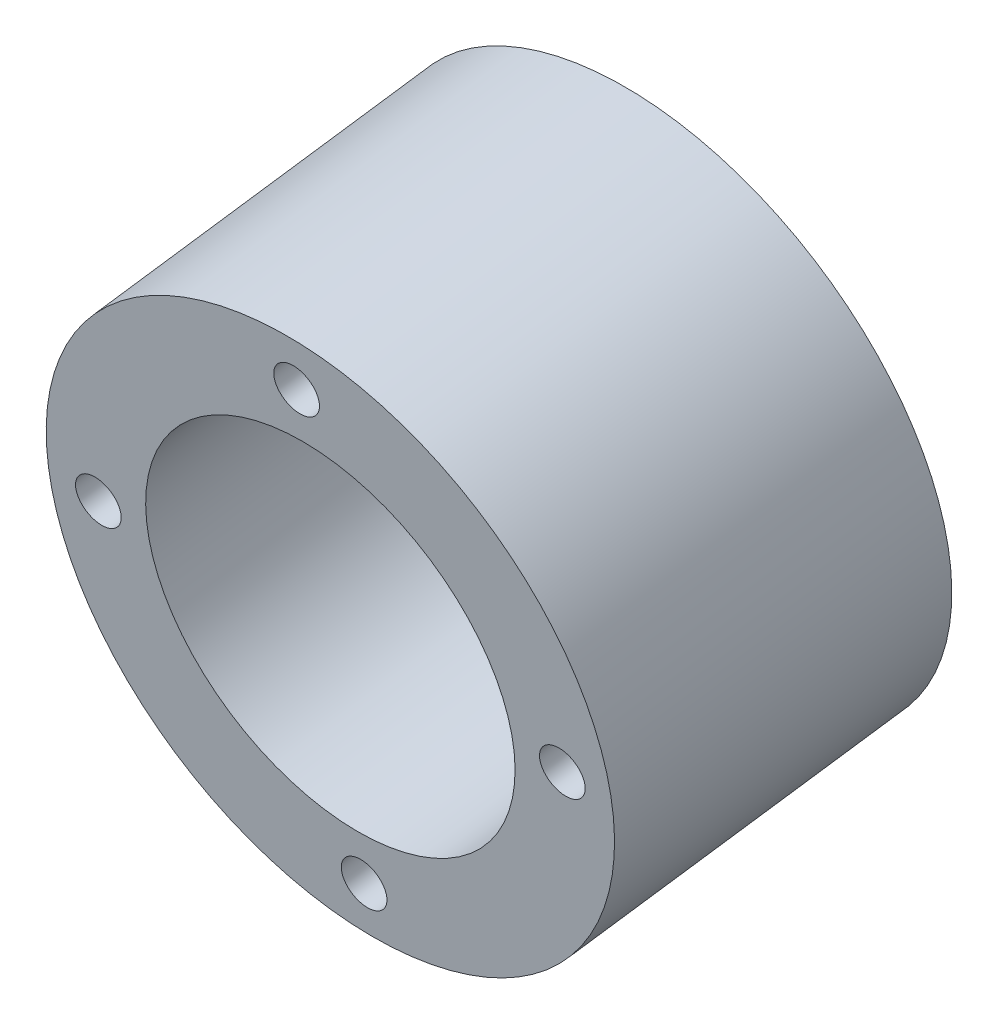
ISO-10303-21;
HEADER;
FILE_DESCRIPTION(('STEP AP214'),'2;1');
FILE_NAME('part.step','',(''),(''),'','','');
FILE_SCHEMA(('AUTOMOTIVE_DESIGN { 1 0 10303 214 1 1 1 1 }'));
ENDSEC;
DATA;
#1=APPLICATION_CONTEXT('core data for automotive mechanical design processes');
#2=APPLICATION_PROTOCOL_DEFINITION('international standard','automotive_design',2000,#1);
#3=PRODUCT_CONTEXT('',#1,'mechanical');
#4=PRODUCT('Part','Part','',(#3));
#5=PRODUCT_RELATED_PRODUCT_CATEGORY('part','',(#4));
#6=PRODUCT_DEFINITION_FORMATION('','',#4);
#7=PRODUCT_DEFINITION_CONTEXT('part definition',#1,'design');
#8=PRODUCT_DEFINITION('design','',#6,#7);
#9=PRODUCT_DEFINITION_SHAPE('','',#8);
#10=(LENGTH_UNIT() NAMED_UNIT(*) SI_UNIT(.MILLI.,.METRE.));
#11=(NAMED_UNIT(*) PLANE_ANGLE_UNIT() SI_UNIT($,.RADIAN.));
#12=(NAMED_UNIT(*) SI_UNIT($,.STERADIAN.) SOLID_ANGLE_UNIT());
#13=UNCERTAINTY_MEASURE_WITH_UNIT(LENGTH_MEASURE(1.E-05),#10,'distance_accuracy_value','');
#14=(GEOMETRIC_REPRESENTATION_CONTEXT(3) GLOBAL_UNCERTAINTY_ASSIGNED_CONTEXT((#13)) GLOBAL_UNIT_ASSIGNED_CONTEXT((#10,
#11,#12)) REPRESENTATION_CONTEXT('',''));
#15=CARTESIAN_POINT('',(0.,0.,0.));
#16=DIRECTION('',(0.,0.,1.));
#17=DIRECTION('',(1.,0.,0.));
#18=AXIS2_PLACEMENT_3D('',#15,#16,#17);
#19=CARTESIAN_POINT('',(0.0954254680110213,580.6831806184,1348.80512087377));
#20=DIRECTION('',(-0.00500921091921221,-0.144685018294151,0.98946508442046));
#21=DIRECTION('',(0.,-0.989477498579028,-0.144686833560589));
#22=AXIS2_PLACEMENT_3D('',#19,#20,#21);
#23=PLANE('',#22);
#24=CARTESIAN_POINT('',(0.0954254680110213,580.6831806184,1348.80512087377));
#25=DIRECTION('',(-0.00500921091921221,-0.144685018294151,0.98946508442046));
#26=DIRECTION('',(0.,-0.989477498579028,-0.144686833560589));
#27=AXIS2_PLACEMENT_3D('',#24,#25,#26);
#28=CIRCLE('',#27,31.75);
#29=CARTESIAN_POINT('',(0.0954254680110213,549.267270038516,1344.21131390822));
#30=VERTEX_POINT('',#29);
#31=EDGE_CURVE('E39',#30,#30,#28,.T.);
#32=ORIENTED_EDGE('',*,*,#31,.F.);
#33=EDGE_LOOP('',(#32));
#34=FACE_BOUND('',#33,.T.);
#35=CARTESIAN_POINT('',(0.0954254680110213,580.6831806184,1348.80512087377));
#36=DIRECTION('',(-0.00500921091921221,-0.144685018294151,0.98946508442046));
#37=DIRECTION('',(0.,-0.989477498579028,-0.144686833560589));
#38=AXIS2_PLACEMENT_3D('',#35,#36,#37);
#39=CIRCLE('',#38,20.6375);
#40=CARTESIAN_POINT('',(0.0954254680110213,560.262838741475,1345.81914634617));
#41=VERTEX_POINT('',#40);
#42=EDGE_CURVE('E48',#41,#41,#39,.T.);
#43=ORIENTED_EDGE('',*,*,#42,.T.);
#44=EDGE_LOOP('',(#43));
#45=FACE_BOUND('',#44,.T.);
#46=CARTESIAN_POINT('',(0.0964213196099178,554.765053686958,1345.01523506594));
#47=DIRECTION('',(0.00500921091921221,0.144685018294151,-0.98946508442046));
#48=DIRECTION('',(0.,0.989477498579028,0.144686833560589));
#49=AXIS2_PLACEMENT_3D('',#46,#47,#48);
#50=CIRCLE('',#49,2.55270000000001);
#51=CARTESIAN_POINT('',(0.0964213196099178,557.290892897581,1345.38457714597));
#52=VERTEX_POINT('',#51);
#53=EDGE_CURVE('E56',#52,#52,#50,.T.);
#54=ORIENTED_EDGE('',*,*,#53,.F.);
#55=EDGE_LOOP('',(#54));
#56=FACE_BOUND('',#55,.T.);
#57=CARTESIAN_POINT('',(-26.097995881668,580.701179595385,1348.67514742454));
#58=DIRECTION('',(0.00500921091921221,0.144685018294151,-0.98946508442046));
#59=DIRECTION('',(0.,0.989477498579028,0.144686833560589));
#60=AXIS2_PLACEMENT_3D('',#57,#58,#59);
#61=CIRCLE('',#60,2.55270000000001);
#62=CARTESIAN_POINT('',(-26.097995881668,583.227018806007,1349.04448950457));
#63=VERTEX_POINT('',#62);
#64=EDGE_CURVE('E62',#63,#63,#61,.T.);
#65=ORIENTED_EDGE('',*,*,#64,.F.);
#66=EDGE_LOOP('',(#65));
#67=FACE_BOUND('',#66,.T.);
#68=CARTESIAN_POINT('',(0.0944296164123068,606.601307549842,1352.59500668161));
#69=DIRECTION('',(0.00500921091921221,0.144685018294151,-0.98946508442046));
#70=DIRECTION('',(0.,0.989477498579028,0.144686833560589));
#71=AXIS2_PLACEMENT_3D('',#68,#69,#70);
#72=CIRCLE('',#71,2.55270000000001);
#73=CARTESIAN_POINT('',(0.0944296164123068,609.127146760464,1352.96434876164));
#74=VERTEX_POINT('',#73);
#75=EDGE_CURVE('E68',#74,#74,#72,.T.);
#76=ORIENTED_EDGE('',*,*,#75,.F.);
#77=EDGE_LOOP('',(#76));
#78=FACE_BOUND('',#77,.T.);
#79=CARTESIAN_POINT('',(26.28884681769,580.665181641415,1348.93509432301));
#80=DIRECTION('',(0.00500921091921221,0.144685018294151,-0.98946508442046));
#81=DIRECTION('',(0.,0.989477498579028,0.144686833560589));
#82=AXIS2_PLACEMENT_3D('',#79,#80,#81);
#83=CIRCLE('',#82,2.55270000000001);
#84=CARTESIAN_POINT('',(26.28884681769,583.191020852037,1349.30443640304));
#85=VERTEX_POINT('',#84);
#86=EDGE_CURVE('E74',#85,#85,#83,.T.);
#87=ORIENTED_EDGE('',*,*,#86,.F.);
#88=EDGE_LOOP('',(#87));
#89=FACE_BOUND('',#88,.T.);
#90=ADVANCED_FACE('F35',(#34,#45,#56,#67,#78,#89),#23,.F.);
#91=CARTESIAN_POINT('',(-0.095425468010964,575.170681421393,1386.50374059019));
#92=DIRECTION('',(-0.00500921091921221,-0.144685018294151,0.98946508442046));
#93=DIRECTION('',(0.,-0.989477498579028,-0.144686833560589));
#94=AXIS2_PLACEMENT_3D('',#91,#92,#93);
#95=PLANE('',#94);
#96=CARTESIAN_POINT('',(26.0979958816681,575.152682444408,1386.63371403943));
#97=DIRECTION('',(-0.00500921091921221,-0.144685018294151,0.98946508442046));
#98=DIRECTION('',(0.,-0.989477498579028,-0.144686833560589));
#99=AXIS2_PLACEMENT_3D('',#96,#97,#98);
#100=CIRCLE('',#99,2.55270000000001);
#101=CARTESIAN_POINT('',(26.0979958816681,572.626843233785,1386.2643719594));
#102=VERTEX_POINT('',#101);
#103=EDGE_CURVE('E71',#102,#102,#100,.T.);
#104=ORIENTED_EDGE('',*,*,#103,.F.);
#105=EDGE_LOOP('',(#104));
#106=FACE_BOUND('',#105,.T.);
#107=CARTESIAN_POINT('',(-0.0964213196096754,601.088808352834,1390.29362639803));
#108=DIRECTION('',(-0.00500921091921221,-0.144685018294151,0.98946508442046));
#109=DIRECTION('',(0.,-0.989477498579028,-0.144686833560589));
#110=AXIS2_PLACEMENT_3D('',#107,#108,#109);
#111=CIRCLE('',#110,2.55270000000001);
#112=CARTESIAN_POINT('',(-0.0964213196096754,598.562969142212,1389.924284318));
#113=VERTEX_POINT('',#112);
#114=EDGE_CURVE('E65',#113,#113,#111,.T.);
#115=ORIENTED_EDGE('',*,*,#114,.F.);
#116=EDGE_LOOP('',(#115));
#117=FACE_BOUND('',#116,.T.);
#118=CARTESIAN_POINT('',(-26.28884681769,575.188680398377,1386.37376714096));
#119=DIRECTION('',(-0.00500921091921221,-0.144685018294151,0.98946508442046));
#120=DIRECTION('',(0.,-0.989477498579028,-0.144686833560589));
#121=AXIS2_PLACEMENT_3D('',#118,#119,#120);
#122=CIRCLE('',#121,2.55270000000001);
#123=CARTESIAN_POINT('',(-26.28884681769,572.662841187755,1386.00442506093));
#124=VERTEX_POINT('',#123);
#125=EDGE_CURVE('E59',#124,#124,#122,.T.);
#126=ORIENTED_EDGE('',*,*,#125,.F.);
#127=EDGE_LOOP('',(#126));
#128=FACE_BOUND('',#127,.T.);
#129=CARTESIAN_POINT('',(-0.0944296164120648,549.252554489951,1382.71385478236));
#130=DIRECTION('',(-0.00500921091921221,-0.144685018294151,0.98946508442046));
#131=DIRECTION('',(0.,-0.989477498579028,-0.144686833560589));
#132=AXIS2_PLACEMENT_3D('',#129,#130,#131);
#133=CIRCLE('',#132,2.55270000000001);
#134=CARTESIAN_POINT('',(-0.0944296164120648,546.726715279328,1382.34451270233));
#135=VERTEX_POINT('',#134);
#136=EDGE_CURVE('E51',#135,#135,#133,.T.);
#137=ORIENTED_EDGE('',*,*,#136,.F.);
#138=EDGE_LOOP('',(#137));
#139=FACE_BOUND('',#138,.T.);
#140=CARTESIAN_POINT('',(-0.095425468010964,575.170681421393,1386.50374059019));
#141=DIRECTION('',(-0.00500921091921221,-0.144685018294151,0.98946508442046));
#142=DIRECTION('',(0.,-0.989477498579028,-0.144686833560589));
#143=AXIS2_PLACEMENT_3D('',#140,#141,#142);
#144=CIRCLE('',#143,31.75);
#145=CARTESIAN_POINT('',(-0.095425468010964,543.754770841509,1381.90993362464));
#146=VERTEX_POINT('',#145);
#147=EDGE_CURVE('E10',#146,#146,#144,.T.);
#148=ORIENTED_EDGE('',*,*,#147,.T.);
#149=EDGE_LOOP('',(#148));
#150=FACE_BOUND('',#149,.T.);
#151=CARTESIAN_POINT('',(-0.095425468010964,575.170681421393,1386.50374059019));
#152=DIRECTION('',(-0.00500921091921221,-0.144685018294151,0.98946508442046));
#153=DIRECTION('',(0.,-0.989477498579028,-0.144686833560589));
#154=AXIS2_PLACEMENT_3D('',#151,#152,#153);
#155=CIRCLE('',#154,20.6375);
#156=CARTESIAN_POINT('',(-0.095425468010964,554.750339544468,1383.51776606259));
#157=VERTEX_POINT('',#156);
#158=EDGE_CURVE('E46',#157,#157,#155,.T.);
#159=ORIENTED_EDGE('',*,*,#158,.F.);
#160=EDGE_LOOP('',(#159));
#161=FACE_BOUND('',#160,.T.);
#162=ADVANCED_FACE('F82',(#106,#117,#128,#139,#150,#161),#95,.T.);
#163=CARTESIAN_POINT('',(-0.095425468010964,575.170681421393,1386.50374059019));
#164=DIRECTION('',(0.00500921091921221,0.144685018294151,-0.98946508442046));
#165=DIRECTION('',(0.,0.989477498579028,0.144686833560589));
#166=AXIS2_PLACEMENT_3D('',#163,#164,#165);
#167=CYLINDRICAL_SURFACE('',#166,31.75);
#168=ORIENTED_EDGE('',*,*,#147,.F.);
#169=EDGE_LOOP('',(#168));
#170=FACE_BOUND('',#169,.T.);
#171=ORIENTED_EDGE('',*,*,#31,.T.);
#172=EDGE_LOOP('',(#171));
#173=FACE_BOUND('',#172,.T.);
#174=ADVANCED_FACE('F37',(#170,#173),#167,.T.);
#175=CARTESIAN_POINT('',(-0.095425468010964,575.170681421393,1386.50374059019));
#176=DIRECTION('',(0.00500921091921221,0.144685018294151,-0.98946508442046));
#177=DIRECTION('',(0.,0.989477498579028,0.144686833560589));
#178=AXIS2_PLACEMENT_3D('',#175,#176,#177);
#179=CYLINDRICAL_SURFACE('',#178,20.6375);
#180=ORIENTED_EDGE('',*,*,#158,.T.);
#181=EDGE_LOOP('',(#180));
#182=FACE_BOUND('',#181,.T.);
#183=ORIENTED_EDGE('',*,*,#42,.F.);
#184=EDGE_LOOP('',(#183));
#185=FACE_BOUND('',#184,.T.);
#186=ADVANCED_FACE('F92',(#182,#185),#179,.F.);
#187=CARTESIAN_POINT('',(0.0964213196099177,554.765053686958,1345.01523506594));
#188=DIRECTION('',(0.00500921091921221,0.144685018294151,-0.98946508442046));
#189=DIRECTION('',(0.,0.989477498579028,0.144686833560589));
#190=AXIS2_PLACEMENT_3D('',#187,#188,#189);
#191=CYLINDRICAL_SURFACE('',#190,2.55270000000001);
#192=ORIENTED_EDGE('',*,*,#53,.T.);
#193=EDGE_LOOP('',(#192));
#194=FACE_BOUND('',#193,.T.);
#195=ORIENTED_EDGE('',*,*,#136,.T.);
#196=EDGE_LOOP('',(#195));
#197=FACE_BOUND('',#196,.T.);
#198=ADVANCED_FACE('F95',(#194,#197),#191,.F.);
#199=CARTESIAN_POINT('',(-26.097995881668,580.701179595385,1348.67514742454));
#200=DIRECTION('',(0.00500921091921221,0.144685018294151,-0.98946508442046));
#201=DIRECTION('',(0.,0.989477498579028,0.144686833560589));
#202=AXIS2_PLACEMENT_3D('',#199,#200,#201);
#203=CYLINDRICAL_SURFACE('',#202,2.55270000000001);
#204=ORIENTED_EDGE('',*,*,#64,.T.);
#205=EDGE_LOOP('',(#204));
#206=FACE_BOUND('',#205,.T.);
#207=ORIENTED_EDGE('',*,*,#125,.T.);
#208=EDGE_LOOP('',(#207));
#209=FACE_BOUND('',#208,.T.);
#210=ADVANCED_FACE('F99',(#206,#209),#203,.F.);
#211=CARTESIAN_POINT('',(0.0944296164123067,606.601307549842,1352.59500668161));
#212=DIRECTION('',(0.00500921091921221,0.144685018294151,-0.98946508442046));
#213=DIRECTION('',(0.,0.989477498579028,0.144686833560589));
#214=AXIS2_PLACEMENT_3D('',#211,#212,#213);
#215=CYLINDRICAL_SURFACE('',#214,2.55270000000001);
#216=ORIENTED_EDGE('',*,*,#75,.T.);
#217=EDGE_LOOP('',(#216));
#218=FACE_BOUND('',#217,.T.);
#219=ORIENTED_EDGE('',*,*,#114,.T.);
#220=EDGE_LOOP('',(#219));
#221=FACE_BOUND('',#220,.T.);
#222=ADVANCED_FACE('F103',(#218,#221),#215,.F.);
#223=CARTESIAN_POINT('',(26.28884681769,580.665181641415,1348.93509432301));
#224=DIRECTION('',(0.00500921091921221,0.144685018294151,-0.98946508442046));
#225=DIRECTION('',(0.,0.989477498579028,0.144686833560589));
#226=AXIS2_PLACEMENT_3D('',#223,#224,#225);
#227=CYLINDRICAL_SURFACE('',#226,2.55270000000001);
#228=ORIENTED_EDGE('',*,*,#86,.T.);
#229=EDGE_LOOP('',(#228));
#230=FACE_BOUND('',#229,.T.);
#231=ORIENTED_EDGE('',*,*,#103,.T.);
#232=EDGE_LOOP('',(#231));
#233=FACE_BOUND('',#232,.T.);
#234=ADVANCED_FACE('F78',(#230,#233),#227,.F.);
#235=CLOSED_SHELL('',(#90,#162,#174,#186,#198,#210,#222,#234));
#236=MANIFOLD_SOLID_BREP('B2',#235);
#237=ADVANCED_BREP_SHAPE_REPRESENTATION('',(#18,#236),#14);
#238=SHAPE_DEFINITION_REPRESENTATION(#9,#237);
ENDSEC;
END-ISO-10303-21;
